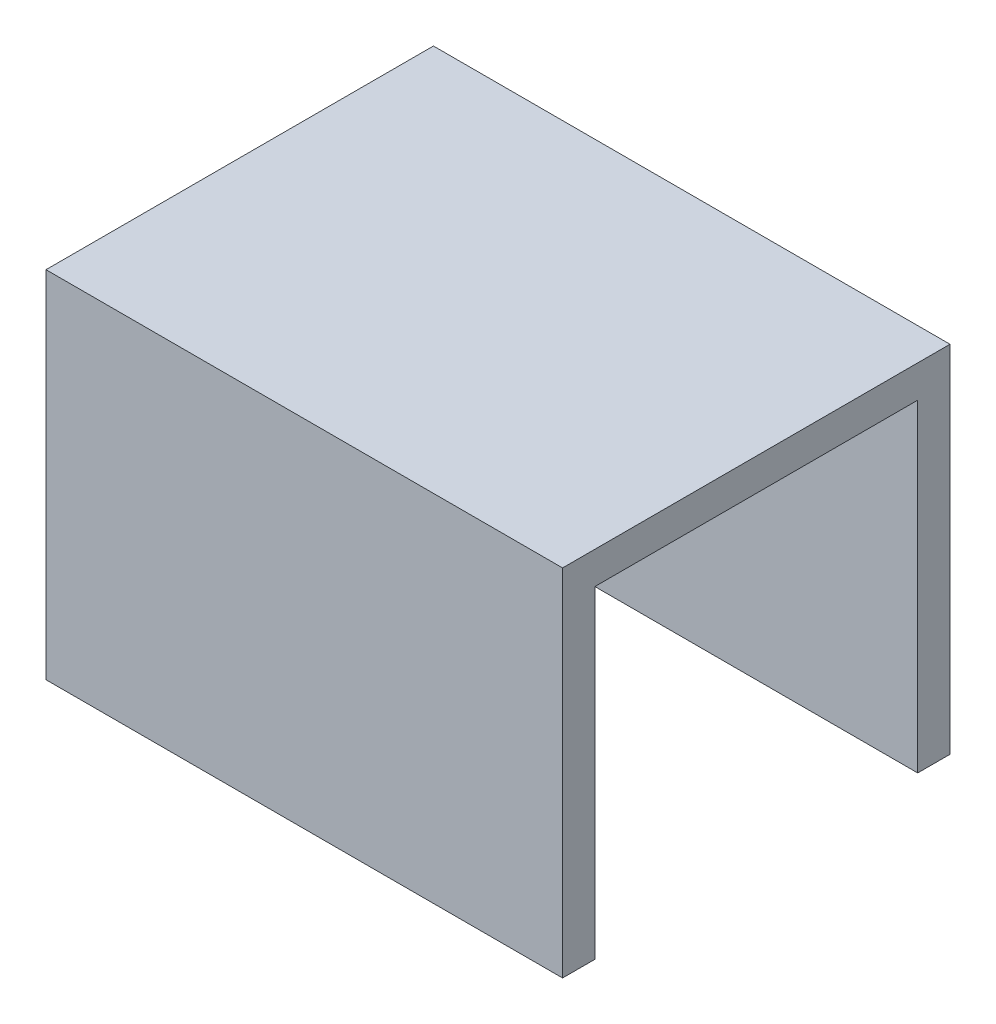
ISO-10303-21;
HEADER;
FILE_DESCRIPTION(('STEP AP214'),'2;1');
FILE_NAME('part.step','',(''),(''),'','','');
FILE_SCHEMA(('AUTOMOTIVE_DESIGN { 1 0 10303 214 1 1 1 1 }'));
ENDSEC;
DATA;
#1=APPLICATION_CONTEXT('core data for automotive mechanical design processes');
#2=APPLICATION_PROTOCOL_DEFINITION('international standard','automotive_design',2000,#1);
#3=PRODUCT_CONTEXT('',#1,'mechanical');
#4=PRODUCT('Part','Part','',(#3));
#5=PRODUCT_RELATED_PRODUCT_CATEGORY('part','',(#4));
#6=PRODUCT_DEFINITION_FORMATION('','',#4);
#7=PRODUCT_DEFINITION_CONTEXT('part definition',#1,'design');
#8=PRODUCT_DEFINITION('design','',#6,#7);
#9=PRODUCT_DEFINITION_SHAPE('','',#8);
#10=(LENGTH_UNIT() NAMED_UNIT(*) SI_UNIT(.MILLI.,.METRE.));
#11=(NAMED_UNIT(*) PLANE_ANGLE_UNIT() SI_UNIT($,.RADIAN.));
#12=(NAMED_UNIT(*) SI_UNIT($,.STERADIAN.) SOLID_ANGLE_UNIT());
#13=UNCERTAINTY_MEASURE_WITH_UNIT(LENGTH_MEASURE(1.E-05),#10,'distance_accuracy_value','');
#14=(GEOMETRIC_REPRESENTATION_CONTEXT(3) GLOBAL_UNCERTAINTY_ASSIGNED_CONTEXT((#13)) GLOBAL_UNIT_ASSIGNED_CONTEXT((#10,
#11,#12)) REPRESENTATION_CONTEXT('',''));
#15=CARTESIAN_POINT('',(0.,0.,0.));
#16=DIRECTION('',(0.,0.,1.));
#17=DIRECTION('',(1.,0.,0.));
#18=AXIS2_PLACEMENT_3D('',#15,#16,#17);
#19=CARTESIAN_POINT('',(25.4,0.,9.525));
#20=DIRECTION('',(0.,1.,0.));
#21=DIRECTION('',(0.,0.,1.));
#22=AXIS2_PLACEMENT_3D('',#19,#20,#21);
#23=PLANE('',#22);
#24=DIRECTION('',(0.,0.,-1.));
#25=VECTOR('',#24,1.);
#26=CARTESIAN_POINT('',(0.,0.,9.525));
#27=LINE('',#26,#25);
#28=CARTESIAN_POINT('',(0.,0.,9.525));
#29=VERTEX_POINT('',#28);
#30=CARTESIAN_POINT('',(0.,0.,7.9375));
#31=VERTEX_POINT('',#30);
#32=EDGE_CURVE('E428',#29,#31,#27,.T.);
#33=ORIENTED_EDGE('',*,*,#32,.T.);
#34=DIRECTION('',(-1.,0.,0.));
#35=VECTOR('',#34,1.);
#36=CARTESIAN_POINT('',(25.4,0.,7.9375));
#37=LINE('',#36,#35);
#38=CARTESIAN_POINT('',(25.4,0.,7.9375));
#39=VERTEX_POINT('',#38);
#40=EDGE_CURVE('E11',#39,#31,#37,.T.);
#41=ORIENTED_EDGE('',*,*,#40,.F.);
#42=DIRECTION('',(0.,0.,-1.));
#43=VECTOR('',#42,1.);
#44=CARTESIAN_POINT('',(25.4,0.,9.525));
#45=LINE('',#44,#43);
#46=CARTESIAN_POINT('',(25.4,0.,9.525));
#47=VERTEX_POINT('',#46);
#48=EDGE_CURVE('E455',#47,#39,#45,.T.);
#49=ORIENTED_EDGE('',*,*,#48,.F.);
#50=DIRECTION('',(-1.,0.,0.));
#51=VECTOR('',#50,1.);
#52=CARTESIAN_POINT('',(25.4,0.,9.525));
#53=LINE('',#52,#51);
#54=EDGE_CURVE('E441',#47,#29,#53,.T.);
#55=ORIENTED_EDGE('',*,*,#54,.T.);
#56=EDGE_LOOP('',(#33,#41,#49,#55));
#57=FACE_BOUND('',#56,.T.);
#58=ADVANCED_FACE('F360',(#57),#23,.F.);
#59=CARTESIAN_POINT('',(25.4,0.,7.9375));
#60=DIRECTION('',(0.,0.,1.));
#61=DIRECTION('',(1.,0.,0.));
#62=AXIS2_PLACEMENT_3D('',#59,#60,#61);
#63=PLANE('',#62);
#64=DIRECTION('',(0.,1.,0.));
#65=VECTOR('',#64,1.);
#66=CARTESIAN_POINT('',(0.,0.,7.9375));
#67=LINE('',#66,#65);
#68=CARTESIAN_POINT('',(0.,15.875,7.9375));
#69=VERTEX_POINT('',#68);
#70=EDGE_CURVE('E424',#31,#69,#67,.T.);
#71=ORIENTED_EDGE('',*,*,#70,.T.);
#72=DIRECTION('',(-1.,0.,0.));
#73=VECTOR('',#72,1.);
#74=CARTESIAN_POINT('',(25.4,15.875,7.9375));
#75=LINE('',#74,#73);
#76=CARTESIAN_POINT('',(25.4,15.875,7.9375));
#77=VERTEX_POINT('',#76);
#78=EDGE_CURVE('E367',#77,#69,#75,.T.);
#79=ORIENTED_EDGE('',*,*,#78,.F.);
#80=DIRECTION('',(0.,1.,0.));
#81=VECTOR('',#80,1.);
#82=CARTESIAN_POINT('',(25.4,0.,7.9375));
#83=LINE('',#82,#81);
#84=EDGE_CURVE('E437',#39,#77,#83,.T.);
#85=ORIENTED_EDGE('',*,*,#84,.F.);
#86=ORIENTED_EDGE('',*,*,#40,.T.);
#87=EDGE_LOOP('',(#71,#79,#85,#86));
#88=FACE_BOUND('',#87,.T.);
#89=ADVANCED_FACE('F436',(#88),#63,.F.);
#90=CARTESIAN_POINT('',(25.4,15.875,7.9375));
#91=DIRECTION('',(0.,1.,0.));
#92=DIRECTION('',(0.,0.,1.));
#93=AXIS2_PLACEMENT_3D('',#90,#91,#92);
#94=PLANE('',#93);
#95=DIRECTION('',(0.,0.,-1.));
#96=VECTOR('',#95,1.);
#97=CARTESIAN_POINT('',(0.,15.875,7.9375));
#98=LINE('',#97,#96);
#99=CARTESIAN_POINT('',(0.,15.875,-7.9375));
#100=VERTEX_POINT('',#99);
#101=EDGE_CURVE('E430',#69,#100,#98,.T.);
#102=ORIENTED_EDGE('',*,*,#101,.T.);
#103=DIRECTION('',(-1.,0.,0.));
#104=VECTOR('',#103,1.);
#105=CARTESIAN_POINT('',(25.4,15.875,-7.9375));
#106=LINE('',#105,#104);
#107=CARTESIAN_POINT('',(25.4,15.875,-7.9375));
#108=VERTEX_POINT('',#107);
#109=EDGE_CURVE('E481',#108,#100,#106,.T.);
#110=ORIENTED_EDGE('',*,*,#109,.F.);
#111=DIRECTION('',(0.,0.,-1.));
#112=VECTOR('',#111,1.);
#113=CARTESIAN_POINT('',(25.4,15.875,7.9375));
#114=LINE('',#113,#112);
#115=EDGE_CURVE('E458',#77,#108,#114,.T.);
#116=ORIENTED_EDGE('',*,*,#115,.F.);
#117=ORIENTED_EDGE('',*,*,#78,.T.);
#118=EDGE_LOOP('',(#102,#110,#116,#117));
#119=FACE_BOUND('',#118,.T.);
#120=ADVANCED_FACE('F485',(#119),#94,.F.);
#121=CARTESIAN_POINT('',(25.4,15.875,-7.9375));
#122=DIRECTION('',(0.,0.,-1.));
#123=DIRECTION('',(0.,1.,0.));
#124=AXIS2_PLACEMENT_3D('',#121,#122,#123);
#125=PLANE('',#124);
#126=DIRECTION('',(0.,-1.,0.));
#127=VECTOR('',#126,1.);
#128=CARTESIAN_POINT('',(0.,15.875,-7.9375));
#129=LINE('',#128,#127);
#130=CARTESIAN_POINT('',(0.,0.,-7.93750000000001));
#131=VERTEX_POINT('',#130);
#132=EDGE_CURVE('E445',#100,#131,#129,.T.);
#133=ORIENTED_EDGE('',*,*,#132,.T.);
#134=DIRECTION('',(-1.,0.,0.));
#135=VECTOR('',#134,1.);
#136=CARTESIAN_POINT('',(25.4,0.,-7.93750000000001));
#137=LINE('',#136,#135);
#138=CARTESIAN_POINT('',(25.4,0.,-7.93750000000001));
#139=VERTEX_POINT('',#138);
#140=EDGE_CURVE('E478',#139,#131,#137,.T.);
#141=ORIENTED_EDGE('',*,*,#140,.F.);
#142=DIRECTION('',(0.,-1.,0.));
#143=VECTOR('',#142,1.);
#144=CARTESIAN_POINT('',(25.4,15.875,-7.9375));
#145=LINE('',#144,#143);
#146=EDGE_CURVE('E460',#108,#139,#145,.T.);
#147=ORIENTED_EDGE('',*,*,#146,.F.);
#148=ORIENTED_EDGE('',*,*,#109,.T.);
#149=EDGE_LOOP('',(#133,#141,#147,#148));
#150=FACE_BOUND('',#149,.T.);
#151=ADVANCED_FACE('F493',(#150),#125,.F.);
#152=CARTESIAN_POINT('',(25.4,0.,-7.93750000000001));
#153=DIRECTION('',(0.,1.,0.));
#154=DIRECTION('',(0.,0.,1.));
#155=AXIS2_PLACEMENT_3D('',#152,#153,#154);
#156=PLANE('',#155);
#157=DIRECTION('',(0.,0.,-1.));
#158=VECTOR('',#157,1.);
#159=CARTESIAN_POINT('',(0.,0.,-7.93750000000001));
#160=LINE('',#159,#158);
#161=CARTESIAN_POINT('',(0.,0.,-9.52500000000001));
#162=VERTEX_POINT('',#161);
#163=EDGE_CURVE('E447',#131,#162,#160,.T.);
#164=ORIENTED_EDGE('',*,*,#163,.T.);
#165=DIRECTION('',(-1.,0.,0.));
#166=VECTOR('',#165,1.);
#167=CARTESIAN_POINT('',(25.4,0.,-9.52500000000001));
#168=LINE('',#167,#166);
#169=CARTESIAN_POINT('',(25.4,0.,-9.52500000000001));
#170=VERTEX_POINT('',#169);
#171=EDGE_CURVE('E475',#170,#162,#168,.T.);
#172=ORIENTED_EDGE('',*,*,#171,.F.);
#173=DIRECTION('',(0.,0.,-1.));
#174=VECTOR('',#173,1.);
#175=CARTESIAN_POINT('',(25.4,0.,-7.93750000000001));
#176=LINE('',#175,#174);
#177=EDGE_CURVE('E462',#139,#170,#176,.T.);
#178=ORIENTED_EDGE('',*,*,#177,.F.);
#179=ORIENTED_EDGE('',*,*,#140,.T.);
#180=EDGE_LOOP('',(#164,#172,#178,#179));
#181=FACE_BOUND('',#180,.T.);
#182=ADVANCED_FACE('F496',(#181),#156,.F.);
#183=CARTESIAN_POINT('',(25.4,0.,-9.52500000000001));
#184=DIRECTION('',(0.,0.,1.));
#185=DIRECTION('',(1.,0.,0.));
#186=AXIS2_PLACEMENT_3D('',#183,#184,#185);
#187=PLANE('',#186);
#188=DIRECTION('',(0.,1.,0.));
#189=VECTOR('',#188,1.);
#190=CARTESIAN_POINT('',(0.,0.,-9.52500000000001));
#191=LINE('',#190,#189);
#192=CARTESIAN_POINT('',(0.,17.4625,-9.52500000000001));
#193=VERTEX_POINT('',#192);
#194=EDGE_CURVE('E449',#162,#193,#191,.T.);
#195=ORIENTED_EDGE('',*,*,#194,.T.);
#196=DIRECTION('',(-1.,0.,0.));
#197=VECTOR('',#196,1.);
#198=CARTESIAN_POINT('',(25.4,17.4625,-9.52500000000001));
#199=LINE('',#198,#197);
#200=CARTESIAN_POINT('',(25.4,17.4625,-9.52500000000001));
#201=VERTEX_POINT('',#200);
#202=EDGE_CURVE('E472',#201,#193,#199,.T.);
#203=ORIENTED_EDGE('',*,*,#202,.F.);
#204=DIRECTION('',(0.,1.,0.));
#205=VECTOR('',#204,1.);
#206=CARTESIAN_POINT('',(25.4,0.,-9.52500000000001));
#207=LINE('',#206,#205);
#208=EDGE_CURVE('E464',#170,#201,#207,.T.);
#209=ORIENTED_EDGE('',*,*,#208,.F.);
#210=ORIENTED_EDGE('',*,*,#171,.T.);
#211=EDGE_LOOP('',(#195,#203,#209,#210));
#212=FACE_BOUND('',#211,.T.);
#213=ADVANCED_FACE('F501',(#212),#187,.F.);
#214=CARTESIAN_POINT('',(25.4,17.4625,-9.52500000000001));
#215=DIRECTION('',(0.,-1.,0.));
#216=DIRECTION('',(0.,0.,-1.));
#217=AXIS2_PLACEMENT_3D('',#214,#215,#216);
#218=PLANE('',#217);
#219=DIRECTION('',(0.,0.,1.));
#220=VECTOR('',#219,1.);
#221=CARTESIAN_POINT('',(0.,17.4625,-9.52500000000001));
#222=LINE('',#221,#220);
#223=CARTESIAN_POINT('',(0.,17.4625,9.525));
#224=VERTEX_POINT('',#223);
#225=EDGE_CURVE('E451',#193,#224,#222,.T.);
#226=ORIENTED_EDGE('',*,*,#225,.T.);
#227=DIRECTION('',(-1.,0.,0.));
#228=VECTOR('',#227,1.);
#229=CARTESIAN_POINT('',(25.4,17.4625,9.525));
#230=LINE('',#229,#228);
#231=CARTESIAN_POINT('',(25.4,17.4625,9.525));
#232=VERTEX_POINT('',#231);
#233=EDGE_CURVE('E469',#232,#224,#230,.T.);
#234=ORIENTED_EDGE('',*,*,#233,.F.);
#235=DIRECTION('',(0.,0.,1.));
#236=VECTOR('',#235,1.);
#237=CARTESIAN_POINT('',(25.4,17.4625,-9.52500000000001));
#238=LINE('',#237,#236);
#239=EDGE_CURVE('E379',#201,#232,#238,.T.);
#240=ORIENTED_EDGE('',*,*,#239,.F.);
#241=ORIENTED_EDGE('',*,*,#202,.T.);
#242=EDGE_LOOP('',(#226,#234,#240,#241));
#243=FACE_BOUND('',#242,.T.);
#244=ADVANCED_FACE('F504',(#243),#218,.F.);
#245=CARTESIAN_POINT('',(25.4,17.4625,9.525));
#246=DIRECTION('',(0.,0.,-1.));
#247=DIRECTION('',(-1.,0.,0.));
#248=AXIS2_PLACEMENT_3D('',#245,#246,#247);
#249=PLANE('',#248);
#250=DIRECTION('',(0.,-1.,0.));
#251=VECTOR('',#250,1.);
#252=CARTESIAN_POINT('',(0.,17.4625,9.525));
#253=LINE('',#252,#251);
#254=EDGE_CURVE('E453',#224,#29,#253,.T.);
#255=ORIENTED_EDGE('',*,*,#254,.T.);
#256=ORIENTED_EDGE('',*,*,#54,.F.);
#257=DIRECTION('',(0.,-1.,0.));
#258=VECTOR('',#257,1.);
#259=CARTESIAN_POINT('',(25.4,17.4625,9.525));
#260=LINE('',#259,#258);
#261=EDGE_CURVE('E374',#232,#47,#260,.T.);
#262=ORIENTED_EDGE('',*,*,#261,.F.);
#263=ORIENTED_EDGE('',*,*,#233,.T.);
#264=EDGE_LOOP('',(#255,#256,#262,#263));
#265=FACE_BOUND('',#264,.T.);
#266=ADVANCED_FACE('F506',(#265),#249,.F.);
#267=CARTESIAN_POINT('',(25.4,0.,7.9375));
#268=DIRECTION('',(1.,0.,0.));
#269=DIRECTION('',(0.,0.,-1.));
#270=AXIS2_PLACEMENT_3D('',#267,#268,#269);
#271=PLANE('',#270);
#272=ORIENTED_EDGE('',*,*,#48,.T.);
#273=ORIENTED_EDGE('',*,*,#84,.T.);
#274=ORIENTED_EDGE('',*,*,#115,.T.);
#275=ORIENTED_EDGE('',*,*,#146,.T.);
#276=ORIENTED_EDGE('',*,*,#177,.T.);
#277=ORIENTED_EDGE('',*,*,#208,.T.);
#278=ORIENTED_EDGE('',*,*,#239,.T.);
#279=ORIENTED_EDGE('',*,*,#261,.T.);
#280=EDGE_LOOP('',(#272,#273,#274,#275,#276,#277,#278,#279));
#281=FACE_BOUND('',#280,.T.);
#282=ADVANCED_FACE('F488',(#281),#271,.T.);
#283=CARTESIAN_POINT('',(0.,0.,7.9375));
#284=DIRECTION('',(1.,0.,0.));
#285=DIRECTION('',(0.,0.,-1.));
#286=AXIS2_PLACEMENT_3D('',#283,#284,#285);
#287=PLANE('',#286);
#288=ORIENTED_EDGE('',*,*,#32,.F.);
#289=ORIENTED_EDGE('',*,*,#254,.F.);
#290=ORIENTED_EDGE('',*,*,#225,.F.);
#291=ORIENTED_EDGE('',*,*,#194,.F.);
#292=ORIENTED_EDGE('',*,*,#163,.F.);
#293=ORIENTED_EDGE('',*,*,#132,.F.);
#294=ORIENTED_EDGE('',*,*,#101,.F.);
#295=ORIENTED_EDGE('',*,*,#70,.F.);
#296=EDGE_LOOP('',(#288,#289,#290,#291,#292,#293,#294,#295));
#297=FACE_BOUND('',#296,.T.);
#298=ADVANCED_FACE('F425',(#297),#287,.F.);
#299=CLOSED_SHELL('',(#58,#89,#120,#151,#182,#213,#244,#266,#282,#298));
#300=MANIFOLD_SOLID_BREP('B2',#299);
#301=ADVANCED_BREP_SHAPE_REPRESENTATION('',(#18,#300),#14);
#302=SHAPE_DEFINITION_REPRESENTATION(#9,#301);
ENDSEC;
END-ISO-10303-21;
